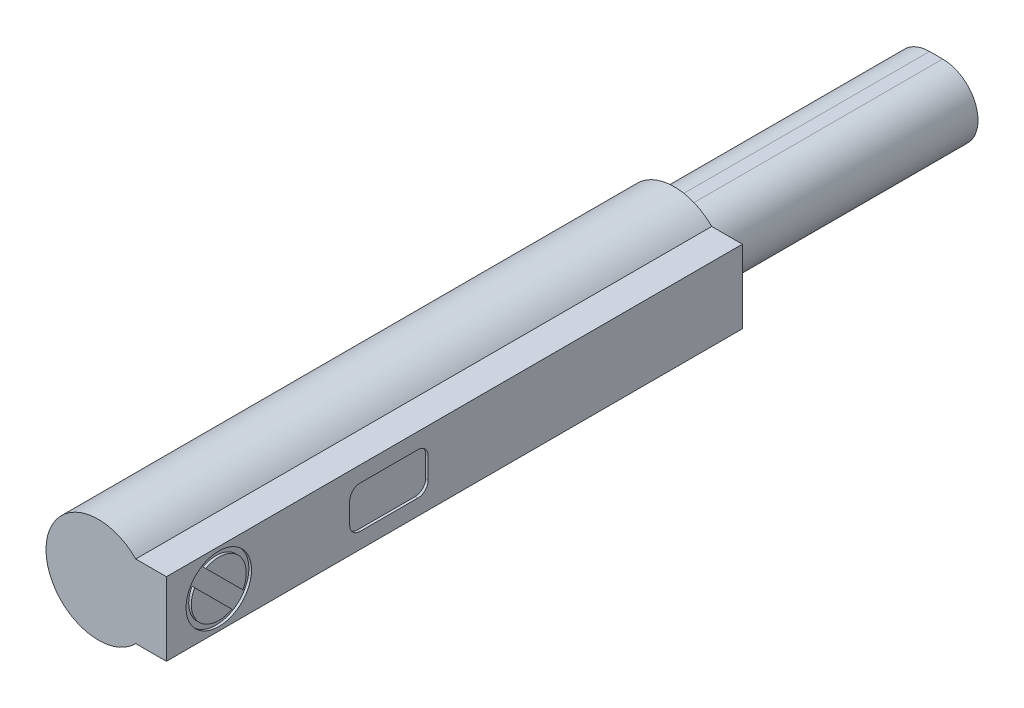
ISO-10303-21;
HEADER;
FILE_DESCRIPTION(('STEP AP214'),'2;1');
FILE_NAME('part.step','',(''),(''),'','','');
FILE_SCHEMA(('AUTOMOTIVE_DESIGN { 1 0 10303 214 1 1 1 1 }'));
ENDSEC;
DATA;
#1=APPLICATION_CONTEXT('core data for automotive mechanical design processes');
#2=APPLICATION_PROTOCOL_DEFINITION('international standard','automotive_design',2000,#1);
#3=PRODUCT_CONTEXT('',#1,'mechanical');
#4=PRODUCT('Part','Part','',(#3));
#5=PRODUCT_RELATED_PRODUCT_CATEGORY('part','',(#4));
#6=PRODUCT_DEFINITION_FORMATION('','',#4);
#7=PRODUCT_DEFINITION_CONTEXT('part definition',#1,'design');
#8=PRODUCT_DEFINITION('design','',#6,#7);
#9=PRODUCT_DEFINITION_SHAPE('','',#8);
#10=(LENGTH_UNIT() NAMED_UNIT(*) SI_UNIT(.MILLI.,.METRE.));
#11=(NAMED_UNIT(*) PLANE_ANGLE_UNIT() SI_UNIT($,.RADIAN.));
#12=(NAMED_UNIT(*) SI_UNIT($,.STERADIAN.) SOLID_ANGLE_UNIT());
#13=UNCERTAINTY_MEASURE_WITH_UNIT(LENGTH_MEASURE(1.E-05),#10,'distance_accuracy_value','');
#14=(GEOMETRIC_REPRESENTATION_CONTEXT(3) GLOBAL_UNCERTAINTY_ASSIGNED_CONTEXT((#13)) GLOBAL_UNIT_ASSIGNED_CONTEXT((#10,
#11,#12)) REPRESENTATION_CONTEXT('',''));
#15=CARTESIAN_POINT('',(0.,0.,0.));
#16=DIRECTION('',(0.,0.,1.));
#17=DIRECTION('',(1.,0.,0.));
#18=AXIS2_PLACEMENT_3D('',#15,#16,#17);
#19=CARTESIAN_POINT('',(2.5,0.,-2.));
#20=DIRECTION('',(1.,0.,0.));
#21=DIRECTION('',(0.,0.,-1.));
#22=AXIS2_PLACEMENT_3D('',#19,#20,#21);
#23=CYLINDRICAL_SURFACE('',#22,1.05);
#24=DIRECTION('',(1.,0.,0.));
#25=VECTOR('',#24,1.);
#26=CARTESIAN_POINT('',(2.5,0.92364450789384,-1.50061956081806));
#27=LINE('',#26,#25);
#28=CARTESIAN_POINT('',(2.6,0.92364450789384,-1.50061956081806));
#29=VERTEX_POINT('',#28);
#30=CARTESIAN_POINT('',(2.5,0.92364450789384,-1.50061956081806));
#31=VERTEX_POINT('',#30);
#32=EDGE_CURVE('E510',#29,#31,#27,.F.);
#33=ORIENTED_EDGE('',*,*,#32,.F.);
#34=CARTESIAN_POINT('',(2.6,0.,-2.));
#35=DIRECTION('',(1.,0.,0.));
#36=DIRECTION('',(0.,0.,-1.));
#37=AXIS2_PLACEMENT_3D('',#34,#35,#36);
#38=CIRCLE('',#37,1.05);
#39=CARTESIAN_POINT('',(2.6,-0.499380439181934,-2.92364450789384));
#40=VERTEX_POINT('',#39);
#41=EDGE_CURVE('E183',#40,#29,#38,.T.);
#42=ORIENTED_EDGE('',*,*,#41,.F.);
#43=DIRECTION('',(1.,0.,0.));
#44=VECTOR('',#43,1.);
#45=CARTESIAN_POINT('',(2.5,-0.499380439181933,-2.92364450789384));
#46=LINE('',#45,#44);
#47=CARTESIAN_POINT('',(2.5,-0.499380439181933,-2.92364450789384));
#48=VERTEX_POINT('',#47);
#49=EDGE_CURVE('E179',#48,#40,#46,.T.);
#50=ORIENTED_EDGE('',*,*,#49,.F.);
#51=CARTESIAN_POINT('',(2.5,0.,-2.));
#52=DIRECTION('',(1.,0.,0.));
#53=DIRECTION('',(0.,0.,-1.));
#54=AXIS2_PLACEMENT_3D('',#51,#52,#53);
#55=CIRCLE('',#54,1.05);
#56=EDGE_CURVE('E182',#48,#31,#55,.T.);
#57=ORIENTED_EDGE('',*,*,#56,.T.);
#58=EDGE_LOOP('',(#33,#42,#50,#57));
#59=FACE_BOUND('',#58,.T.);
#60=ADVANCED_FACE('F32',(#59),#23,.T.);
#61=CARTESIAN_POINT('',(2.6,-1.4,-22.));
#62=DIRECTION('',(1.,0.,0.));
#63=DIRECTION('',(0.,0.,-1.));
#64=AXIS2_PLACEMENT_3D('',#61,#62,#63);
#65=PLANE('',#64);
#66=DIRECTION('',(0.,0.707106781186545,0.70710678118655));
#67=VECTOR('',#66,1.);
#68=CARTESIAN_POINT('',(2.6,-10.487867965644,-12.912132034356));
#69=LINE('',#68,#67);
#70=EDGE_CURVE('E11',#40,#29,#69,.T.);
#71=ORIENTED_EDGE('',*,*,#70,.F.);
#72=ORIENTED_EDGE('',*,*,#41,.T.);
#73=EDGE_LOOP('',(#71,#72));
#74=FACE_BOUND('',#73,.T.);
#75=ADVANCED_FACE('F282',(#74),#65,.T.);
#76=CARTESIAN_POINT('',(0.,0.,-22.));
#77=DIRECTION('',(0.,0.,1.));
#78=DIRECTION('',(1.,0.,0.));
#79=AXIS2_PLACEMENT_3D('',#76,#77,#78);
#80=CYLINDRICAL_SURFACE('',#79,2.00000000000001);
#81=CARTESIAN_POINT('',(0.,0.,0.));
#82=DIRECTION('',(0.,0.,1.));
#83=DIRECTION('',(1.,0.,0.));
#84=AXIS2_PLACEMENT_3D('',#81,#82,#83);
#85=CIRCLE('',#84,2.00000000000001);
#86=CARTESIAN_POINT('',(1.4282856857086,1.4,0.));
#87=VERTEX_POINT('',#86);
#88=CARTESIAN_POINT('',(1.4282856857086,-1.4,0.));
#89=VERTEX_POINT('',#88);
#90=EDGE_CURVE('E224',#87,#89,#85,.T.);
#91=ORIENTED_EDGE('',*,*,#90,.F.);
#92=DIRECTION('',(0.,0.,1.));
#93=VECTOR('',#92,1.);
#94=CARTESIAN_POINT('',(1.4282856857086,1.4,-22.));
#95=LINE('',#94,#93);
#96=CARTESIAN_POINT('',(1.4282856857086,1.4,-22.));
#97=VERTEX_POINT('',#96);
#98=EDGE_CURVE('E172',#97,#87,#95,.T.);
#99=ORIENTED_EDGE('',*,*,#98,.F.);
#100=CARTESIAN_POINT('',(0.,0.,-22.));
#101=DIRECTION('',(0.,0.,1.));
#102=DIRECTION('',(1.,0.,0.));
#103=AXIS2_PLACEMENT_3D('',#100,#101,#102);
#104=CIRCLE('',#103,2.00000000000001);
#105=CARTESIAN_POINT('',(1.4282856857086,-1.4,-22.));
#106=VERTEX_POINT('',#105);
#107=EDGE_CURVE('E231',#97,#106,#104,.T.);
#108=ORIENTED_EDGE('',*,*,#107,.T.);
#109=DIRECTION('',(0.,0.,1.));
#110=VECTOR('',#109,1.);
#111=CARTESIAN_POINT('',(1.4282856857086,-1.4,-22.));
#112=LINE('',#111,#110);
#113=EDGE_CURVE('E244',#106,#89,#112,.T.);
#114=ORIENTED_EDGE('',*,*,#113,.T.);
#115=EDGE_LOOP('',(#91,#99,#108,#114));
#116=FACE_BOUND('',#115,.T.);
#117=ADVANCED_FACE('F34',(#116),#80,.T.);
#118=CARTESIAN_POINT('',(2.6,1.4,-22.));
#119=DIRECTION('',(0.,1.,0.));
#120=DIRECTION('',(0.,0.,1.));
#121=AXIS2_PLACEMENT_3D('',#118,#119,#120);
#122=PLANE('',#121);
#123=DIRECTION('',(-1.,0.,0.));
#124=VECTOR('',#123,1.);
#125=CARTESIAN_POINT('',(2.6,1.4,0.));
#126=LINE('',#125,#124);
#127=CARTESIAN_POINT('',(2.6,1.4,0.));
#128=VERTEX_POINT('',#127);
#129=EDGE_CURVE('E235',#128,#87,#126,.T.);
#130=ORIENTED_EDGE('',*,*,#129,.F.);
#131=DIRECTION('',(0.,0.,1.));
#132=VECTOR('',#131,1.);
#133=CARTESIAN_POINT('',(2.6,1.4,-22.));
#134=LINE('',#133,#132);
#135=CARTESIAN_POINT('',(2.6,1.4,-22.));
#136=VERTEX_POINT('',#135);
#137=EDGE_CURVE('E256',#136,#128,#134,.T.);
#138=ORIENTED_EDGE('',*,*,#137,.F.);
#139=DIRECTION('',(-1.,0.,0.));
#140=VECTOR('',#139,1.);
#141=CARTESIAN_POINT('',(2.6,1.4,-22.));
#142=LINE('',#141,#140);
#143=EDGE_CURVE('E241',#136,#97,#142,.T.);
#144=ORIENTED_EDGE('',*,*,#143,.T.);
#145=ORIENTED_EDGE('',*,*,#98,.T.);
#146=EDGE_LOOP('',(#130,#138,#144,#145));
#147=FACE_BOUND('',#146,.T.);
#148=ADVANCED_FACE('F272',(#147),#122,.T.);
#149=CARTESIAN_POINT('',(2.6,-0.399999999999979,-7.40000000000003));
#150=DIRECTION('',(1.,0.,0.));
#151=DIRECTION('',(0.,0.,-1.));
#152=AXIS2_PLACEMENT_3D('',#149,#150,#151);
#153=CIRCLE('',#152,0.400000000000031);
#154=CARTESIAN_POINT('',(2.6,-0.40000000000001,-7.));
#155=VERTEX_POINT('',#154);
#156=CARTESIAN_POINT('',(2.6,-0.80000000000001,-7.4));
#157=VERTEX_POINT('',#156);
#158=EDGE_CURVE('E55',#155,#157,#153,.T.);
#159=ORIENTED_EDGE('',*,*,#158,.F.);
#160=DIRECTION('',(0.,-1.,0.));
#161=VECTOR('',#160,1.);
#162=CARTESIAN_POINT('',(2.6,0.4,-7.));
#163=LINE('',#162,#161);
#164=CARTESIAN_POINT('',(2.6,0.4,-7.));
#165=VERTEX_POINT('',#164);
#166=EDGE_CURVE('E526',#165,#155,#163,.T.);
#167=ORIENTED_EDGE('',*,*,#166,.F.);
#168=CARTESIAN_POINT('',(2.6,0.399999999999968,-7.40000000000003));
#169=DIRECTION('',(1.,0.,0.));
#170=DIRECTION('',(0.,0.,-1.));
#171=AXIS2_PLACEMENT_3D('',#168,#169,#170);
#172=CIRCLE('',#171,0.400000000000032);
#173=CARTESIAN_POINT('',(2.6,0.8,-7.4));
#174=VERTEX_POINT('',#173);
#175=EDGE_CURVE('E564',#174,#165,#172,.T.);
#176=ORIENTED_EDGE('',*,*,#175,.F.);
#177=DIRECTION('',(0.,0.,1.));
#178=VECTOR('',#177,1.);
#179=CARTESIAN_POINT('',(2.6,0.8,-9.6));
#180=LINE('',#179,#178);
#181=CARTESIAN_POINT('',(2.6,0.8,-9.6));
#182=VERTEX_POINT('',#181);
#183=EDGE_CURVE('E561',#182,#174,#180,.T.);
#184=ORIENTED_EDGE('',*,*,#183,.F.);
#185=CARTESIAN_POINT('',(2.6,0.399999999999968,-9.59999999999997));
#186=DIRECTION('',(1.,0.,0.));
#187=DIRECTION('',(0.,0.,-1.));
#188=AXIS2_PLACEMENT_3D('',#185,#186,#187);
#189=CIRCLE('',#188,0.400000000000032);
#190=CARTESIAN_POINT('',(2.6,0.4,-10.));
#191=VERTEX_POINT('',#190);
#192=EDGE_CURVE('E558',#191,#182,#189,.T.);
#193=ORIENTED_EDGE('',*,*,#192,.F.);
#194=DIRECTION('',(0.,1.,0.));
#195=VECTOR('',#194,1.);
#196=CARTESIAN_POINT('',(2.6,-0.40000000000001,-10.));
#197=LINE('',#196,#195);
#198=CARTESIAN_POINT('',(2.6,-0.40000000000001,-10.));
#199=VERTEX_POINT('',#198);
#200=EDGE_CURVE('E555',#199,#191,#197,.T.);
#201=ORIENTED_EDGE('',*,*,#200,.F.);
#202=CARTESIAN_POINT('',(2.6,-0.399999999999962,-9.59999999999995));
#203=DIRECTION('',(1.,0.,0.));
#204=DIRECTION('',(0.,0.,-1.));
#205=AXIS2_PLACEMENT_3D('',#202,#203,#204);
#206=CIRCLE('',#205,0.400000000000048);
#207=CARTESIAN_POINT('',(2.6,-0.80000000000001,-9.6));
#208=VERTEX_POINT('',#207);
#209=EDGE_CURVE('E552',#208,#199,#206,.T.);
#210=ORIENTED_EDGE('',*,*,#209,.F.);
#211=DIRECTION('',(0.,0.,-1.));
#212=VECTOR('',#211,1.);
#213=CARTESIAN_POINT('',(2.6,-0.80000000000001,-7.4));
#214=LINE('',#213,#212);
#215=EDGE_CURVE('E549',#157,#208,#214,.T.);
#216=ORIENTED_EDGE('',*,*,#215,.F.);
#217=EDGE_LOOP('',(#159,#167,#176,#184,#193,#201,#210,#216));
#218=FACE_BOUND('',#217,.T.);
#219=CARTESIAN_POINT('',(2.6,0.,-2.));
#220=DIRECTION('',(1.,0.,0.));
#221=DIRECTION('',(0.,0.,-1.));
#222=AXIS2_PLACEMENT_3D('',#219,#220,#221);
#223=CIRCLE('',#222,1.25);
#224=CARTESIAN_POINT('',(2.6,0.,-3.25));
#225=VERTEX_POINT('',#224);
#226=EDGE_CURVE('E195',#225,#225,#223,.T.);
#227=ORIENTED_EDGE('',*,*,#226,.F.);
#228=EDGE_LOOP('',(#227));
#229=FACE_BOUND('',#228,.T.);
#230=DIRECTION('',(0.,1.,0.));
#231=VECTOR('',#230,1.);
#232=CARTESIAN_POINT('',(2.6,-1.4,0.));
#233=LINE('',#232,#231);
#234=CARTESIAN_POINT('',(2.6,-1.4,0.));
#235=VERTEX_POINT('',#234);
#236=EDGE_CURVE('E250',#235,#128,#233,.T.);
#237=ORIENTED_EDGE('',*,*,#236,.F.);
#238=DIRECTION('',(0.,0.,1.));
#239=VECTOR('',#238,1.);
#240=CARTESIAN_POINT('',(2.6,-1.4,-22.));
#241=LINE('',#240,#239);
#242=CARTESIAN_POINT('',(2.6,-1.4,-22.));
#243=VERTEX_POINT('',#242);
#244=EDGE_CURVE('E258',#243,#235,#241,.T.);
#245=ORIENTED_EDGE('',*,*,#244,.F.);
#246=DIRECTION('',(0.,1.,0.));
#247=VECTOR('',#246,1.);
#248=CARTESIAN_POINT('',(2.6,-1.4,-22.));
#249=LINE('',#248,#247);
#250=EDGE_CURVE('E238',#243,#136,#249,.T.);
#251=ORIENTED_EDGE('',*,*,#250,.T.);
#252=ORIENTED_EDGE('',*,*,#137,.T.);
#253=EDGE_LOOP('',(#237,#245,#251,#252));
#254=FACE_BOUND('',#253,.T.);
#255=ADVANCED_FACE('F278',(#218,#229,#254),#65,.T.);
#256=CARTESIAN_POINT('',(1.4282856857086,-1.4,-22.));
#257=DIRECTION('',(0.,-1.,0.));
#258=DIRECTION('',(0.,0.,-1.));
#259=AXIS2_PLACEMENT_3D('',#256,#257,#258);
#260=PLANE('',#259);
#261=DIRECTION('',(1.,0.,0.));
#262=VECTOR('',#261,1.);
#263=CARTESIAN_POINT('',(1.4282856857086,-1.4,0.));
#264=LINE('',#263,#262);
#265=EDGE_CURVE('E247',#89,#235,#264,.T.);
#266=ORIENTED_EDGE('',*,*,#265,.F.);
#267=ORIENTED_EDGE('',*,*,#113,.F.);
#268=DIRECTION('',(1.,0.,0.));
#269=VECTOR('',#268,1.);
#270=CARTESIAN_POINT('',(1.4282856857086,-1.4,-22.));
#271=LINE('',#270,#269);
#272=EDGE_CURVE('E234',#106,#243,#271,.T.);
#273=ORIENTED_EDGE('',*,*,#272,.T.);
#274=ORIENTED_EDGE('',*,*,#244,.T.);
#275=EDGE_LOOP('',(#266,#267,#273,#274));
#276=FACE_BOUND('',#275,.T.);
#277=ADVANCED_FACE('F266',(#276),#260,.T.);
#278=CARTESIAN_POINT('',(0.,0.,-22.));
#279=DIRECTION('',(0.,0.,1.));
#280=DIRECTION('',(1.,0.,0.));
#281=AXIS2_PLACEMENT_3D('',#278,#279,#280);
#282=PLANE('',#281);
#283=DIRECTION('',(-1.,0.,0.));
#284=VECTOR('',#283,1.);
#285=CARTESIAN_POINT('',(0.25,1.35,-22.));
#286=LINE('',#285,#284);
#287=CARTESIAN_POINT('',(0.25,1.35,-22.));
#288=VERTEX_POINT('',#287);
#289=CARTESIAN_POINT('',(-0.25,1.35,-22.));
#290=VERTEX_POINT('',#289);
#291=EDGE_CURVE('E202',#288,#290,#286,.T.);
#292=ORIENTED_EDGE('',*,*,#291,.T.);
#293=CARTESIAN_POINT('',(-0.25,0.,-22.));
#294=DIRECTION('',(0.,0.,1.));
#295=DIRECTION('',(1.,0.,0.));
#296=AXIS2_PLACEMENT_3D('',#293,#294,#295);
#297=CIRCLE('',#296,1.35);
#298=CARTESIAN_POINT('',(-0.25,-1.35,-22.));
#299=VERTEX_POINT('',#298);
#300=EDGE_CURVE('E194',#290,#299,#297,.T.);
#301=ORIENTED_EDGE('',*,*,#300,.T.);
#302=DIRECTION('',(1.,0.,0.));
#303=VECTOR('',#302,1.);
#304=CARTESIAN_POINT('',(-0.25,-1.35,-22.));
#305=LINE('',#304,#303);
#306=CARTESIAN_POINT('',(0.25,-1.35,-22.));
#307=VERTEX_POINT('',#306);
#308=EDGE_CURVE('E214',#299,#307,#305,.T.);
#309=ORIENTED_EDGE('',*,*,#308,.T.);
#310=CARTESIAN_POINT('',(0.25,0.,-22.));
#311=DIRECTION('',(0.,0.,1.));
#312=DIRECTION('',(1.,0.,0.));
#313=AXIS2_PLACEMENT_3D('',#310,#311,#312);
#314=CIRCLE('',#313,1.35);
#315=EDGE_CURVE('E217',#307,#288,#314,.T.);
#316=ORIENTED_EDGE('',*,*,#315,.T.);
#317=EDGE_LOOP('',(#292,#301,#309,#316));
#318=FACE_BOUND('',#317,.T.);
#319=ORIENTED_EDGE('',*,*,#107,.F.);
#320=ORIENTED_EDGE('',*,*,#143,.F.);
#321=ORIENTED_EDGE('',*,*,#250,.F.);
#322=ORIENTED_EDGE('',*,*,#272,.F.);
#323=EDGE_LOOP('',(#319,#320,#321,#322));
#324=FACE_BOUND('',#323,.T.);
#325=ADVANCED_FACE('F275',(#318,#324),#282,.F.);
#326=CARTESIAN_POINT('',(0.,0.,0.));
#327=DIRECTION('',(0.,0.,1.));
#328=DIRECTION('',(1.,0.,0.));
#329=AXIS2_PLACEMENT_3D('',#326,#327,#328);
#330=PLANE('',#329);
#331=ORIENTED_EDGE('',*,*,#90,.T.);
#332=ORIENTED_EDGE('',*,*,#265,.T.);
#333=ORIENTED_EDGE('',*,*,#236,.T.);
#334=ORIENTED_EDGE('',*,*,#129,.T.);
#335=EDGE_LOOP('',(#331,#332,#333,#334));
#336=FACE_BOUND('',#335,.T.);
#337=ADVANCED_FACE('F269',(#336),#330,.T.);
#338=CARTESIAN_POINT('',(-0.25,0.,-32.));
#339=DIRECTION('',(0.,0.,1.));
#340=DIRECTION('',(1.,0.,0.));
#341=AXIS2_PLACEMENT_3D('',#338,#339,#340);
#342=CYLINDRICAL_SURFACE('',#341,1.35);
#343=ORIENTED_EDGE('',*,*,#300,.F.);
#344=DIRECTION('',(0.,0.,1.));
#345=VECTOR('',#344,1.);
#346=CARTESIAN_POINT('',(-0.25,1.35,-32.));
#347=LINE('',#346,#345);
#348=CARTESIAN_POINT('',(-0.25,1.35,-32.));
#349=VERTEX_POINT('',#348);
#350=EDGE_CURVE('E222',#349,#290,#347,.T.);
#351=ORIENTED_EDGE('',*,*,#350,.F.);
#352=CARTESIAN_POINT('',(-0.25,0.,-32.));
#353=DIRECTION('',(0.,0.,1.));
#354=DIRECTION('',(1.,0.,0.));
#355=AXIS2_PLACEMENT_3D('',#352,#353,#354);
#356=CIRCLE('',#355,1.35);
#357=CARTESIAN_POINT('',(-0.25,-1.35,-32.));
#358=VERTEX_POINT('',#357);
#359=EDGE_CURVE('E198',#349,#358,#356,.T.);
#360=ORIENTED_EDGE('',*,*,#359,.T.);
#361=DIRECTION('',(0.,0.,1.));
#362=VECTOR('',#361,1.);
#363=CARTESIAN_POINT('',(-0.25,-1.35,-32.));
#364=LINE('',#363,#362);
#365=EDGE_CURVE('E211',#358,#299,#364,.T.);
#366=ORIENTED_EDGE('',*,*,#365,.T.);
#367=EDGE_LOOP('',(#343,#351,#360,#366));
#368=FACE_BOUND('',#367,.T.);
#369=ADVANCED_FACE('F325',(#368),#342,.T.);
#370=CARTESIAN_POINT('',(0.25,1.35,-32.));
#371=DIRECTION('',(0.,1.,0.));
#372=DIRECTION('',(0.,0.,1.));
#373=AXIS2_PLACEMENT_3D('',#370,#371,#372);
#374=PLANE('',#373);
#375=ORIENTED_EDGE('',*,*,#291,.F.);
#376=DIRECTION('',(0.,0.,1.));
#377=VECTOR('',#376,1.);
#378=CARTESIAN_POINT('',(0.25,1.35,-32.));
#379=LINE('',#378,#377);
#380=CARTESIAN_POINT('',(0.25,1.35,-32.));
#381=VERTEX_POINT('',#380);
#382=EDGE_CURVE('E225',#381,#288,#379,.T.);
#383=ORIENTED_EDGE('',*,*,#382,.F.);
#384=DIRECTION('',(-1.,0.,0.));
#385=VECTOR('',#384,1.);
#386=CARTESIAN_POINT('',(0.25,1.35,-32.));
#387=LINE('',#386,#385);
#388=EDGE_CURVE('E208',#381,#349,#387,.T.);
#389=ORIENTED_EDGE('',*,*,#388,.T.);
#390=ORIENTED_EDGE('',*,*,#350,.T.);
#391=EDGE_LOOP('',(#375,#383,#389,#390));
#392=FACE_BOUND('',#391,.T.);
#393=ADVANCED_FACE('F321',(#392),#374,.T.);
#394=CARTESIAN_POINT('',(0.25,0.,-32.));
#395=DIRECTION('',(0.,0.,1.));
#396=DIRECTION('',(1.,0.,0.));
#397=AXIS2_PLACEMENT_3D('',#394,#395,#396);
#398=CYLINDRICAL_SURFACE('',#397,1.35);
#399=ORIENTED_EDGE('',*,*,#315,.F.);
#400=DIRECTION('',(0.,0.,1.));
#401=VECTOR('',#400,1.);
#402=CARTESIAN_POINT('',(0.25,-1.35,-32.));
#403=LINE('',#402,#401);
#404=CARTESIAN_POINT('',(0.25,-1.35,-32.));
#405=VERTEX_POINT('',#404);
#406=EDGE_CURVE('E227',#405,#307,#403,.T.);
#407=ORIENTED_EDGE('',*,*,#406,.F.);
#408=CARTESIAN_POINT('',(0.25,0.,-32.));
#409=DIRECTION('',(0.,0.,1.));
#410=DIRECTION('',(1.,0.,0.));
#411=AXIS2_PLACEMENT_3D('',#408,#409,#410);
#412=CIRCLE('',#411,1.35);
#413=EDGE_CURVE('E205',#405,#381,#412,.T.);
#414=ORIENTED_EDGE('',*,*,#413,.T.);
#415=ORIENTED_EDGE('',*,*,#382,.T.);
#416=EDGE_LOOP('',(#399,#407,#414,#415));
#417=FACE_BOUND('',#416,.T.);
#418=ADVANCED_FACE('F324',(#417),#398,.T.);
#419=CARTESIAN_POINT('',(-0.25,-1.35,-32.));
#420=DIRECTION('',(0.,-1.,0.));
#421=DIRECTION('',(0.,0.,-1.));
#422=AXIS2_PLACEMENT_3D('',#419,#420,#421);
#423=PLANE('',#422);
#424=ORIENTED_EDGE('',*,*,#308,.F.);
#425=ORIENTED_EDGE('',*,*,#365,.F.);
#426=DIRECTION('',(1.,0.,0.));
#427=VECTOR('',#426,1.);
#428=CARTESIAN_POINT('',(-0.25,-1.35,-32.));
#429=LINE('',#428,#427);
#430=EDGE_CURVE('E201',#358,#405,#429,.T.);
#431=ORIENTED_EDGE('',*,*,#430,.T.);
#432=ORIENTED_EDGE('',*,*,#406,.T.);
#433=EDGE_LOOP('',(#424,#425,#431,#432));
#434=FACE_BOUND('',#433,.T.);
#435=ADVANCED_FACE('F319',(#434),#423,.T.);
#436=CARTESIAN_POINT('',(-0.25,0.,-32.));
#437=DIRECTION('',(0.,0.,1.));
#438=DIRECTION('',(1.,0.,0.));
#439=AXIS2_PLACEMENT_3D('',#436,#437,#438);
#440=PLANE('',#439);
#441=ORIENTED_EDGE('',*,*,#359,.F.);
#442=ORIENTED_EDGE('',*,*,#388,.F.);
#443=ORIENTED_EDGE('',*,*,#413,.F.);
#444=ORIENTED_EDGE('',*,*,#430,.F.);
#445=EDGE_LOOP('',(#441,#442,#443,#444));
#446=FACE_BOUND('',#445,.T.);
#447=ADVANCED_FACE('F311',(#446),#440,.F.);
#448=CARTESIAN_POINT('',(2.5,0.,-2.));
#449=DIRECTION('',(1.,0.,0.));
#450=DIRECTION('',(0.,0.,-1.));
#451=AXIS2_PLACEMENT_3D('',#448,#449,#450);
#452=CYLINDRICAL_SURFACE('',#451,1.25);
#453=CARTESIAN_POINT('',(2.5,0.,-2.));
#454=DIRECTION('',(1.,0.,0.));
#455=DIRECTION('',(0.,0.,-1.));
#456=AXIS2_PLACEMENT_3D('',#453,#454,#455);
#457=CIRCLE('',#456,1.25);
#458=CARTESIAN_POINT('',(2.5,0.,-3.25));
#459=VERTEX_POINT('',#458);
#460=EDGE_CURVE('E191',#459,#459,#457,.T.);
#461=ORIENTED_EDGE('',*,*,#460,.F.);
#462=EDGE_LOOP('',(#461));
#463=FACE_BOUND('',#462,.T.);
#464=ORIENTED_EDGE('',*,*,#226,.T.);
#465=EDGE_LOOP('',(#464));
#466=FACE_BOUND('',#465,.T.);
#467=ADVANCED_FACE('F306',(#463,#466),#452,.F.);
#468=CARTESIAN_POINT('',(2.5,0.,-2.));
#469=DIRECTION('',(1.,0.,0.));
#470=DIRECTION('',(0.,0.,-1.));
#471=AXIS2_PLACEMENT_3D('',#468,#469,#470);
#472=PLANE('',#471);
#473=ORIENTED_EDGE('',*,*,#56,.F.);
#474=DIRECTION('',(0.,0.707106781186545,0.70710678118655));
#475=VECTOR('',#474,1.);
#476=CARTESIAN_POINT('',(2.5,-0.60945180190179,-3.0337158706137));
#477=LINE('',#476,#475);
#478=EDGE_CURVE('E512',#48,#31,#477,.T.);
#479=ORIENTED_EDGE('',*,*,#478,.T.);
#480=EDGE_LOOP('',(#473,#479));
#481=FACE_BOUND('',#480,.T.);
#482=CARTESIAN_POINT('',(2.5,0.499380439181921,-1.07635549210615));
#483=VERTEX_POINT('',#482);
#484=CARTESIAN_POINT('',(2.5,-0.92364450789384,-2.49938043918194));
#485=VERTEX_POINT('',#484);
#486=EDGE_CURVE('E178',#483,#485,#55,.T.);
#487=ORIENTED_EDGE('',*,*,#486,.F.);
#488=DIRECTION('',(0.,-0.707106781186541,-0.707106781186554));
#489=VECTOR('',#488,1.);
#490=CARTESIAN_POINT('',(2.5,0.60945180190178,-0.96628412938629));
#491=LINE('',#490,#489);
#492=EDGE_CURVE('E517',#483,#485,#491,.T.);
#493=ORIENTED_EDGE('',*,*,#492,.T.);
#494=EDGE_LOOP('',(#487,#493));
#495=FACE_BOUND('',#494,.T.);
#496=ORIENTED_EDGE('',*,*,#460,.T.);
#497=EDGE_LOOP('',(#496));
#498=FACE_BOUND('',#497,.T.);
#499=ADVANCED_FACE('F302',(#481,#495,#498),#472,.T.);
#500=DIRECTION('',(1.,0.,0.));
#501=VECTOR('',#500,1.);
#502=CARTESIAN_POINT('',(2.5,-0.92364450789384,-2.49938043918194));
#503=LINE('',#502,#501);
#504=CARTESIAN_POINT('',(2.6,-0.92364450789384,-2.49938043918194));
#505=VERTEX_POINT('',#504);
#506=EDGE_CURVE('E167',#505,#485,#503,.F.);
#507=ORIENTED_EDGE('',*,*,#506,.F.);
#508=CARTESIAN_POINT('',(2.6,0.499380439181922,-1.07635549210615));
#509=VERTEX_POINT('',#508);
#510=EDGE_CURVE('E176',#509,#505,#38,.T.);
#511=ORIENTED_EDGE('',*,*,#510,.F.);
#512=DIRECTION('',(1.,0.,0.));
#513=VECTOR('',#512,1.);
#514=CARTESIAN_POINT('',(2.5,0.499380439181921,-1.07635549210615));
#515=LINE('',#514,#513);
#516=EDGE_CURVE('E47',#483,#509,#515,.T.);
#517=ORIENTED_EDGE('',*,*,#516,.F.);
#518=ORIENTED_EDGE('',*,*,#486,.T.);
#519=EDGE_LOOP('',(#507,#511,#517,#518));
#520=FACE_BOUND('',#519,.T.);
#521=ADVANCED_FACE('F175',(#520),#23,.T.);
#522=DIRECTION('',(0.,-0.707106781186541,-0.707106781186554));
#523=VECTOR('',#522,1.);
#524=CARTESIAN_POINT('',(2.6,-10.9121320343559,-12.4878679656442));
#525=LINE('',#524,#523);
#526=EDGE_CURVE('E40',#509,#505,#525,.T.);
#527=ORIENTED_EDGE('',*,*,#526,.F.);
#528=ORIENTED_EDGE('',*,*,#510,.T.);
#529=EDGE_LOOP('',(#527,#528));
#530=FACE_BOUND('',#529,.T.);
#531=ADVANCED_FACE('F181',(#530),#65,.T.);
#532=CARTESIAN_POINT('',(2.5,-0.399999999999979,-7.40000000000003));
#533=DIRECTION('',(1.,0.,0.));
#534=DIRECTION('',(0.,0.,-1.));
#535=AXIS2_PLACEMENT_3D('',#532,#533,#534);
#536=CYLINDRICAL_SURFACE('',#535,0.400000000000031);
#537=ORIENTED_EDGE('',*,*,#158,.T.);
#538=DIRECTION('',(1.,0.,0.));
#539=VECTOR('',#538,1.);
#540=CARTESIAN_POINT('',(2.5,-0.80000000000001,-7.4));
#541=LINE('',#540,#539);
#542=CARTESIAN_POINT('',(2.5,-0.80000000000001,-7.4));
#543=VERTEX_POINT('',#542);
#544=EDGE_CURVE('E547',#543,#157,#541,.T.);
#545=ORIENTED_EDGE('',*,*,#544,.F.);
#546=CARTESIAN_POINT('',(2.5,-0.399999999999979,-7.40000000000003));
#547=DIRECTION('',(1.,0.,0.));
#548=DIRECTION('',(0.,0.,-1.));
#549=AXIS2_PLACEMENT_3D('',#546,#547,#548);
#550=CIRCLE('',#549,0.400000000000031);
#551=CARTESIAN_POINT('',(2.5,-0.40000000000001,-7.));
#552=VERTEX_POINT('',#551);
#553=EDGE_CURVE('E522',#552,#543,#550,.T.);
#554=ORIENTED_EDGE('',*,*,#553,.F.);
#555=DIRECTION('',(1.,0.,0.));
#556=VECTOR('',#555,1.);
#557=CARTESIAN_POINT('',(2.5,-0.40000000000001,-7.));
#558=LINE('',#557,#556);
#559=EDGE_CURVE('E188',#552,#155,#558,.T.);
#560=ORIENTED_EDGE('',*,*,#559,.T.);
#561=EDGE_LOOP('',(#537,#545,#554,#560));
#562=FACE_BOUND('',#561,.T.);
#563=ADVANCED_FACE('F292',(#562),#536,.F.);
#564=CARTESIAN_POINT('',(2.5,0.4,-7.));
#565=DIRECTION('',(0.,0.,1.));
#566=DIRECTION('',(1.,0.,0.));
#567=AXIS2_PLACEMENT_3D('',#564,#565,#566);
#568=PLANE('',#567);
#569=ORIENTED_EDGE('',*,*,#166,.T.);
#570=ORIENTED_EDGE('',*,*,#559,.F.);
#571=DIRECTION('',(0.,-1.,0.));
#572=VECTOR('',#571,1.);
#573=CARTESIAN_POINT('',(2.5,0.4,-7.));
#574=LINE('',#573,#572);
#575=CARTESIAN_POINT('',(2.5,0.4,-7.));
#576=VERTEX_POINT('',#575);
#577=EDGE_CURVE('E544',#576,#552,#574,.T.);
#578=ORIENTED_EDGE('',*,*,#577,.F.);
#579=DIRECTION('',(1.,0.,0.));
#580=VECTOR('',#579,1.);
#581=CARTESIAN_POINT('',(2.5,0.4,-7.));
#582=LINE('',#581,#580);
#583=EDGE_CURVE('E570',#576,#165,#582,.T.);
#584=ORIENTED_EDGE('',*,*,#583,.T.);
#585=EDGE_LOOP('',(#569,#570,#578,#584));
#586=FACE_BOUND('',#585,.T.);
#587=ADVANCED_FACE('F386',(#586),#568,.F.);
#588=CARTESIAN_POINT('',(2.5,0.399999999999968,-7.40000000000003));
#589=DIRECTION('',(1.,0.,0.));
#590=DIRECTION('',(0.,0.,-1.));
#591=AXIS2_PLACEMENT_3D('',#588,#589,#590);
#592=CYLINDRICAL_SURFACE('',#591,0.400000000000032);
#593=ORIENTED_EDGE('',*,*,#175,.T.);
#594=ORIENTED_EDGE('',*,*,#583,.F.);
#595=CARTESIAN_POINT('',(2.5,0.399999999999968,-7.40000000000003));
#596=DIRECTION('',(1.,0.,0.));
#597=DIRECTION('',(0.,0.,-1.));
#598=AXIS2_PLACEMENT_3D('',#595,#596,#597);
#599=CIRCLE('',#598,0.400000000000032);
#600=CARTESIAN_POINT('',(2.5,0.8,-7.4));
#601=VERTEX_POINT('',#600);
#602=EDGE_CURVE('E541',#601,#576,#599,.T.);
#603=ORIENTED_EDGE('',*,*,#602,.F.);
#604=DIRECTION('',(1.,0.,0.));
#605=VECTOR('',#604,1.);
#606=CARTESIAN_POINT('',(2.5,0.8,-7.4));
#607=LINE('',#606,#605);
#608=EDGE_CURVE('E572',#601,#174,#607,.T.);
#609=ORIENTED_EDGE('',*,*,#608,.T.);
#610=EDGE_LOOP('',(#593,#594,#603,#609));
#611=FACE_BOUND('',#610,.T.);
#612=ADVANCED_FACE('F395',(#611),#592,.F.);
#613=CARTESIAN_POINT('',(2.5,0.8,-9.6));
#614=DIRECTION('',(0.,1.,0.));
#615=DIRECTION('',(0.,0.,1.));
#616=AXIS2_PLACEMENT_3D('',#613,#614,#615);
#617=PLANE('',#616);
#618=ORIENTED_EDGE('',*,*,#183,.T.);
#619=ORIENTED_EDGE('',*,*,#608,.F.);
#620=DIRECTION('',(0.,0.,1.));
#621=VECTOR('',#620,1.);
#622=CARTESIAN_POINT('',(2.5,0.8,-9.6));
#623=LINE('',#622,#621);
#624=CARTESIAN_POINT('',(2.5,0.8,-9.6));
#625=VERTEX_POINT('',#624);
#626=EDGE_CURVE('E538',#625,#601,#623,.T.);
#627=ORIENTED_EDGE('',*,*,#626,.F.);
#628=DIRECTION('',(1.,0.,0.));
#629=VECTOR('',#628,1.);
#630=CARTESIAN_POINT('',(2.5,0.8,-9.6));
#631=LINE('',#630,#629);
#632=EDGE_CURVE('E574',#625,#182,#631,.T.);
#633=ORIENTED_EDGE('',*,*,#632,.T.);
#634=EDGE_LOOP('',(#618,#619,#627,#633));
#635=FACE_BOUND('',#634,.T.);
#636=ADVANCED_FACE('F405',(#635),#617,.F.);
#637=CARTESIAN_POINT('',(2.5,0.399999999999968,-9.59999999999997));
#638=DIRECTION('',(1.,0.,0.));
#639=DIRECTION('',(0.,0.,-1.));
#640=AXIS2_PLACEMENT_3D('',#637,#638,#639);
#641=CYLINDRICAL_SURFACE('',#640,0.400000000000032);
#642=ORIENTED_EDGE('',*,*,#192,.T.);
#643=ORIENTED_EDGE('',*,*,#632,.F.);
#644=CARTESIAN_POINT('',(2.5,0.399999999999968,-9.59999999999997));
#645=DIRECTION('',(1.,0.,0.));
#646=DIRECTION('',(0.,0.,-1.));
#647=AXIS2_PLACEMENT_3D('',#644,#645,#646);
#648=CIRCLE('',#647,0.400000000000032);
#649=CARTESIAN_POINT('',(2.5,0.4,-10.));
#650=VERTEX_POINT('',#649);
#651=EDGE_CURVE('E535',#650,#625,#648,.T.);
#652=ORIENTED_EDGE('',*,*,#651,.F.);
#653=DIRECTION('',(1.,0.,0.));
#654=VECTOR('',#653,1.);
#655=CARTESIAN_POINT('',(2.5,0.4,-10.));
#656=LINE('',#655,#654);
#657=EDGE_CURVE('E576',#650,#191,#656,.T.);
#658=ORIENTED_EDGE('',*,*,#657,.T.);
#659=EDGE_LOOP('',(#642,#643,#652,#658));
#660=FACE_BOUND('',#659,.T.);
#661=ADVANCED_FACE('F415',(#660),#641,.F.);
#662=CARTESIAN_POINT('',(2.5,-0.40000000000001,-10.));
#663=DIRECTION('',(0.,0.,-1.));
#664=DIRECTION('',(-1.,0.,0.));
#665=AXIS2_PLACEMENT_3D('',#662,#663,#664);
#666=PLANE('',#665);
#667=ORIENTED_EDGE('',*,*,#200,.T.);
#668=ORIENTED_EDGE('',*,*,#657,.F.);
#669=DIRECTION('',(0.,1.,0.));
#670=VECTOR('',#669,1.);
#671=CARTESIAN_POINT('',(2.5,-0.40000000000001,-10.));
#672=LINE('',#671,#670);
#673=CARTESIAN_POINT('',(2.5,-0.40000000000001,-10.));
#674=VERTEX_POINT('',#673);
#675=EDGE_CURVE('E532',#674,#650,#672,.T.);
#676=ORIENTED_EDGE('',*,*,#675,.F.);
#677=DIRECTION('',(1.,0.,0.));
#678=VECTOR('',#677,1.);
#679=CARTESIAN_POINT('',(2.5,-0.40000000000001,-10.));
#680=LINE('',#679,#678);
#681=EDGE_CURVE('E578',#674,#199,#680,.T.);
#682=ORIENTED_EDGE('',*,*,#681,.T.);
#683=EDGE_LOOP('',(#667,#668,#676,#682));
#684=FACE_BOUND('',#683,.T.);
#685=ADVANCED_FACE('F425',(#684),#666,.F.);
#686=CARTESIAN_POINT('',(2.5,-0.399999999999962,-9.59999999999995));
#687=DIRECTION('',(1.,0.,0.));
#688=DIRECTION('',(0.,0.,-1.));
#689=AXIS2_PLACEMENT_3D('',#686,#687,#688);
#690=CYLINDRICAL_SURFACE('',#689,0.400000000000048);
#691=ORIENTED_EDGE('',*,*,#209,.T.);
#692=ORIENTED_EDGE('',*,*,#681,.F.);
#693=CARTESIAN_POINT('',(2.5,-0.399999999999962,-9.59999999999995));
#694=DIRECTION('',(1.,0.,0.));
#695=DIRECTION('',(0.,0.,-1.));
#696=AXIS2_PLACEMENT_3D('',#693,#694,#695);
#697=CIRCLE('',#696,0.400000000000048);
#698=CARTESIAN_POINT('',(2.5,-0.80000000000001,-9.6));
#699=VERTEX_POINT('',#698);
#700=EDGE_CURVE('E529',#699,#674,#697,.T.);
#701=ORIENTED_EDGE('',*,*,#700,.F.);
#702=DIRECTION('',(1.,0.,0.));
#703=VECTOR('',#702,1.);
#704=CARTESIAN_POINT('',(2.5,-0.80000000000001,-9.6));
#705=LINE('',#704,#703);
#706=EDGE_CURVE('E580',#699,#208,#705,.T.);
#707=ORIENTED_EDGE('',*,*,#706,.T.);
#708=EDGE_LOOP('',(#691,#692,#701,#707));
#709=FACE_BOUND('',#708,.T.);
#710=ADVANCED_FACE('F435',(#709),#690,.F.);
#711=CARTESIAN_POINT('',(2.5,-0.80000000000001,-7.4));
#712=DIRECTION('',(0.,-1.,0.));
#713=DIRECTION('',(0.,0.,-1.));
#714=AXIS2_PLACEMENT_3D('',#711,#712,#713);
#715=PLANE('',#714);
#716=ORIENTED_EDGE('',*,*,#215,.T.);
#717=ORIENTED_EDGE('',*,*,#706,.F.);
#718=DIRECTION('',(0.,0.,-1.));
#719=VECTOR('',#718,1.);
#720=CARTESIAN_POINT('',(2.5,-0.80000000000001,-7.4));
#721=LINE('',#720,#719);
#722=EDGE_CURVE('E525',#543,#699,#721,.T.);
#723=ORIENTED_EDGE('',*,*,#722,.F.);
#724=ORIENTED_EDGE('',*,*,#544,.T.);
#725=EDGE_LOOP('',(#716,#717,#723,#724));
#726=FACE_BOUND('',#725,.T.);
#727=ADVANCED_FACE('F445',(#726),#715,.F.);
#728=CARTESIAN_POINT('',(2.5,-0.399999999999979,-7.40000000000003));
#729=DIRECTION('',(1.,0.,0.));
#730=DIRECTION('',(0.,0.,-1.));
#731=AXIS2_PLACEMENT_3D('',#728,#729,#730);
#732=PLANE('',#731);
#733=ORIENTED_EDGE('',*,*,#553,.T.);
#734=ORIENTED_EDGE('',*,*,#722,.T.);
#735=ORIENTED_EDGE('',*,*,#700,.T.);
#736=ORIENTED_EDGE('',*,*,#675,.T.);
#737=ORIENTED_EDGE('',*,*,#651,.T.);
#738=ORIENTED_EDGE('',*,*,#626,.T.);
#739=ORIENTED_EDGE('',*,*,#602,.T.);
#740=ORIENTED_EDGE('',*,*,#577,.T.);
#741=EDGE_LOOP('',(#733,#734,#735,#736,#737,#738,#739,#740));
#742=FACE_BOUND('',#741,.T.);
#743=ADVANCED_FACE('F455',(#742),#732,.T.);
#744=CARTESIAN_POINT('',(2.5,-0.60945180190179,-3.0337158706137));
#745=DIRECTION('',(0.,0.70710678118655,-0.707106781186545));
#746=DIRECTION('',(0.,0.707106781186545,0.70710678118655));
#747=AXIS2_PLACEMENT_3D('',#744,#745,#746);
#748=PLANE('',#747);
#749=ORIENTED_EDGE('',*,*,#32,.T.);
#750=ORIENTED_EDGE('',*,*,#478,.F.);
#751=ORIENTED_EDGE('',*,*,#49,.T.);
#752=ORIENTED_EDGE('',*,*,#70,.T.);
#753=EDGE_LOOP('',(#749,#750,#751,#752));
#754=FACE_BOUND('',#753,.T.);
#755=ADVANCED_FACE('F464',(#754),#748,.F.);
#756=CARTESIAN_POINT('',(2.5,0.60945180190178,-0.96628412938629));
#757=DIRECTION('',(0.,-0.707106781186554,0.707106781186541));
#758=DIRECTION('',(0.,-0.707106781186541,-0.707106781186554));
#759=AXIS2_PLACEMENT_3D('',#756,#757,#758);
#760=PLANE('',#759);
#761=ORIENTED_EDGE('',*,*,#506,.T.);
#762=ORIENTED_EDGE('',*,*,#492,.F.);
#763=ORIENTED_EDGE('',*,*,#516,.T.);
#764=ORIENTED_EDGE('',*,*,#526,.T.);
#765=EDGE_LOOP('',(#761,#762,#763,#764));
#766=FACE_BOUND('',#765,.T.);
#767=ADVANCED_FACE('F166',(#766),#760,.F.);
#768=CLOSED_SHELL('',(#60,#75,#117,#148,#255,#277,#325,#337,#369,#393,#418,#435,#447,#467,#499,
#521,#531,#563,#587,#612,#636,#661,#685,#710,#727,#743,#755,#767));
#769=MANIFOLD_SOLID_BREP('B2',#768);
#770=ADVANCED_BREP_SHAPE_REPRESENTATION('',(#18,#769),#14);
#771=SHAPE_DEFINITION_REPRESENTATION(#9,#770);
ENDSEC;
END-ISO-10303-21;
